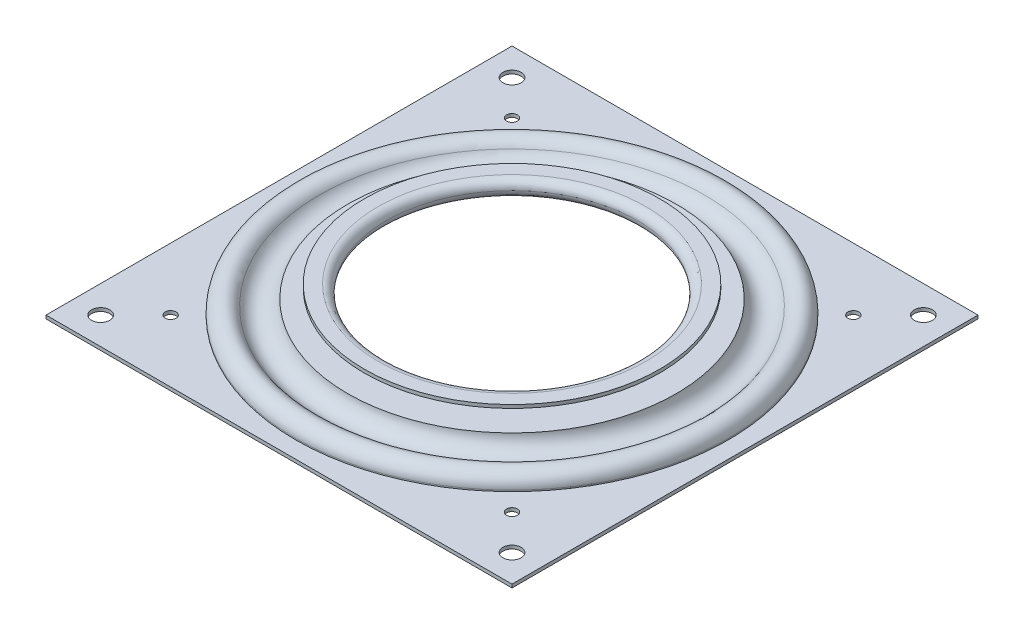
ISO-10303-21;
HEADER;
FILE_DESCRIPTION(('STEP AP214'),'2;1');
FILE_NAME('part.step','',(''),(''),'','','');
FILE_SCHEMA(('AUTOMOTIVE_DESIGN { 1 0 10303 214 1 1 1 1 }'));
ENDSEC;
DATA;
#1=APPLICATION_CONTEXT('core data for automotive mechanical design processes');
#2=APPLICATION_PROTOCOL_DEFINITION('international standard','automotive_design',2000,#1);
#3=PRODUCT_CONTEXT('',#1,'mechanical');
#4=PRODUCT('Part','Part','',(#3));
#5=PRODUCT_RELATED_PRODUCT_CATEGORY('part','',(#4));
#6=PRODUCT_DEFINITION_FORMATION('','',#4);
#7=PRODUCT_DEFINITION_CONTEXT('part definition',#1,'design');
#8=PRODUCT_DEFINITION('design','',#6,#7);
#9=PRODUCT_DEFINITION_SHAPE('','',#8);
#10=(LENGTH_UNIT() NAMED_UNIT(*) SI_UNIT(.MILLI.,.METRE.));
#11=(NAMED_UNIT(*) PLANE_ANGLE_UNIT() SI_UNIT($,.RADIAN.));
#12=(NAMED_UNIT(*) SI_UNIT($,.STERADIAN.) SOLID_ANGLE_UNIT());
#13=UNCERTAINTY_MEASURE_WITH_UNIT(LENGTH_MEASURE(1.E-05),#10,'distance_accuracy_value','');
#14=(GEOMETRIC_REPRESENTATION_CONTEXT(3) GLOBAL_UNCERTAINTY_ASSIGNED_CONTEXT((#13)) GLOBAL_UNIT_ASSIGNED_CONTEXT((#10,
#11,#12)) REPRESENTATION_CONTEXT('',''));
#15=CARTESIAN_POINT('',(0.,0.,0.));
#16=DIRECTION('',(0.,0.,1.));
#17=DIRECTION('',(1.,0.,0.));
#18=AXIS2_PLACEMENT_3D('',#15,#16,#17);
#19=CARTESIAN_POINT('',(0.,0.,0.));
#20=DIRECTION('',(0.,1.,0.));
#21=DIRECTION('',(0.,0.,1.));
#22=AXIS2_PLACEMENT_3D('',#19,#20,#21);
#23=TOROIDAL_SURFACE('',#22,29.21,1.778);
#24=CARTESIAN_POINT('',(0.,-1.778,0.));
#25=DIRECTION('',(0.,1.,0.));
#26=DIRECTION('',(0.,0.,1.));
#27=AXIS2_PLACEMENT_3D('',#24,#25,#26);
#28=CIRCLE('',#27,29.21);
#29=CARTESIAN_POINT('',(0.,-1.778,29.21));
#30=VERTEX_POINT('',#29);
#31=EDGE_CURVE('E116',#30,#30,#28,.T.);
#32=ORIENTED_EDGE('',*,*,#31,.F.);
#33=EDGE_LOOP('',(#32));
#34=FACE_BOUND('',#33,.T.);
#35=CARTESIAN_POINT('',(0.,0.,0.));
#36=DIRECTION('',(0.,1.,0.));
#37=DIRECTION('',(0.,0.,1.));
#38=AXIS2_PLACEMENT_3D('',#35,#36,#37);
#39=CIRCLE('',#38,27.432);
#40=CARTESIAN_POINT('',(0.,0.,27.432));
#41=VERTEX_POINT('',#40);
#42=EDGE_CURVE('E11',#41,#41,#39,.T.);
#43=ORIENTED_EDGE('',*,*,#42,.T.);
#44=EDGE_LOOP('',(#43));
#45=FACE_BOUND('',#44,.T.);
#46=ADVANCED_FACE('F34',(#34,#45),#23,.T.);
#47=CARTESIAN_POINT('',(46.4272908614699,-4.826,0.));
#48=DIRECTION('',(0.,1.,0.));
#49=DIRECTION('',(0.,0.,1.));
#50=AXIS2_PLACEMENT_3D('',#47,#48,#49);
#51=PLANE('',#50);
#52=CARTESIAN_POINT('',(37.211,-4.826,37.211));
#53=DIRECTION('',(0.,1.,0.));
#54=DIRECTION('',(0.,0.,1.));
#55=AXIS2_PLACEMENT_3D('',#52,#53,#54);
#56=CIRCLE('',#55,1.19062499999999);
#57=CARTESIAN_POINT('',(37.211,-4.826,38.401625));
#58=VERTEX_POINT('',#57);
#59=EDGE_CURVE('E423',#58,#58,#56,.T.);
#60=ORIENTED_EDGE('',*,*,#59,.T.);
#61=EDGE_LOOP('',(#60));
#62=FACE_BOUND('',#61,.T.);
#63=CARTESIAN_POINT('',(-37.211,-4.826,37.211));
#64=DIRECTION('',(0.,1.,0.));
#65=DIRECTION('',(0.,0.,1.));
#66=AXIS2_PLACEMENT_3D('',#63,#64,#65);
#67=CIRCLE('',#66,1.19062499999999);
#68=CARTESIAN_POINT('',(-37.211,-4.826,38.401625));
#69=VERTEX_POINT('',#68);
#70=EDGE_CURVE('E427',#69,#69,#67,.T.);
#71=ORIENTED_EDGE('',*,*,#70,.T.);
#72=EDGE_LOOP('',(#71));
#73=FACE_BOUND('',#72,.T.);
#74=CARTESIAN_POINT('',(-37.211,-4.826,-37.211));
#75=DIRECTION('',(0.,1.,0.));
#76=DIRECTION('',(0.,0.,1.));
#77=AXIS2_PLACEMENT_3D('',#74,#75,#76);
#78=CIRCLE('',#77,1.19062499999999);
#79=CARTESIAN_POINT('',(-37.211,-4.826,-36.020375));
#80=VERTEX_POINT('',#79);
#81=EDGE_CURVE('E436',#80,#80,#78,.T.);
#82=ORIENTED_EDGE('',*,*,#81,.T.);
#83=EDGE_LOOP('',(#82));
#84=FACE_BOUND('',#83,.T.);
#85=CARTESIAN_POINT('',(37.211,-4.826,-37.211));
#86=DIRECTION('',(0.,1.,0.));
#87=DIRECTION('',(0.,0.,1.));
#88=AXIS2_PLACEMENT_3D('',#85,#86,#87);
#89=CIRCLE('',#88,1.19062499999999);
#90=CARTESIAN_POINT('',(37.211,-4.826,-36.020375));
#91=VERTEX_POINT('',#90);
#92=EDGE_CURVE('E442',#91,#91,#89,.T.);
#93=ORIENTED_EDGE('',*,*,#92,.T.);
#94=EDGE_LOOP('',(#93));
#95=FACE_BOUND('',#94,.T.);
#96=CARTESIAN_POINT('',(44.8437,-4.826,-44.8437));
#97=DIRECTION('',(0.,1.,0.));
#98=DIRECTION('',(0.,0.,1.));
#99=AXIS2_PLACEMENT_3D('',#96,#97,#98);
#100=CIRCLE('',#99,1.984375);
#101=CARTESIAN_POINT('',(44.8437,-4.826,-42.859325));
#102=VERTEX_POINT('',#101);
#103=EDGE_CURVE('E448',#102,#102,#100,.T.);
#104=ORIENTED_EDGE('',*,*,#103,.T.);
#105=EDGE_LOOP('',(#104));
#106=FACE_BOUND('',#105,.T.);
#107=CARTESIAN_POINT('',(44.8437,-4.826,44.8437));
#108=DIRECTION('',(0.,1.,0.));
#109=DIRECTION('',(0.,0.,1.));
#110=AXIS2_PLACEMENT_3D('',#107,#108,#109);
#111=CIRCLE('',#110,1.984375);
#112=CARTESIAN_POINT('',(44.8437,-4.826,46.828075));
#113=VERTEX_POINT('',#112);
#114=EDGE_CURVE('E454',#113,#113,#111,.T.);
#115=ORIENTED_EDGE('',*,*,#114,.T.);
#116=EDGE_LOOP('',(#115));
#117=FACE_BOUND('',#116,.T.);
#118=CARTESIAN_POINT('',(-44.8437,-4.826,-44.8437));
#119=DIRECTION('',(0.,1.,0.));
#120=DIRECTION('',(0.,0.,1.));
#121=AXIS2_PLACEMENT_3D('',#118,#119,#120);
#122=CIRCLE('',#121,1.984375);
#123=CARTESIAN_POINT('',(-44.8437,-4.826,-42.859325));
#124=VERTEX_POINT('',#123);
#125=EDGE_CURVE('E460',#124,#124,#122,.T.);
#126=ORIENTED_EDGE('',*,*,#125,.T.);
#127=EDGE_LOOP('',(#126));
#128=FACE_BOUND('',#127,.T.);
#129=CARTESIAN_POINT('',(-44.8437,-4.826,44.8437));
#130=DIRECTION('',(0.,1.,0.));
#131=DIRECTION('',(0.,0.,1.));
#132=AXIS2_PLACEMENT_3D('',#129,#130,#131);
#133=CIRCLE('',#132,1.984375);
#134=CARTESIAN_POINT('',(-44.8437,-4.826,46.828075));
#135=VERTEX_POINT('',#134);
#136=EDGE_CURVE('E81',#135,#135,#133,.T.);
#137=ORIENTED_EDGE('',*,*,#136,.T.);
#138=EDGE_LOOP('',(#137));
#139=FACE_BOUND('',#138,.T.);
#140=DIRECTION('',(1.,0.,0.));
#141=VECTOR('',#140,1.);
#142=CARTESIAN_POINT('',(50.8,-4.826,-50.8));
#143=LINE('',#142,#141);
#144=CARTESIAN_POINT('',(-50.8,-4.826,-50.8));
#145=VERTEX_POINT('',#144);
#146=CARTESIAN_POINT('',(50.8,-4.826,-50.8));
#147=VERTEX_POINT('',#146);
#148=EDGE_CURVE('E94',#145,#147,#143,.T.);
#149=ORIENTED_EDGE('',*,*,#148,.T.);
#150=DIRECTION('',(0.,0.,1.));
#151=VECTOR('',#150,1.);
#152=CARTESIAN_POINT('',(50.8,-4.826,50.8));
#153=LINE('',#152,#151);
#154=CARTESIAN_POINT('',(50.8,-4.826,50.8));
#155=VERTEX_POINT('',#154);
#156=EDGE_CURVE('E472',#147,#155,#153,.T.);
#157=ORIENTED_EDGE('',*,*,#156,.T.);
#158=DIRECTION('',(-1.,0.,0.));
#159=VECTOR('',#158,1.);
#160=CARTESIAN_POINT('',(50.8,-4.826,50.8));
#161=LINE('',#160,#159);
#162=CARTESIAN_POINT('',(-50.8,-4.826,50.8));
#163=VERTEX_POINT('',#162);
#164=EDGE_CURVE('E469',#155,#163,#161,.T.);
#165=ORIENTED_EDGE('',*,*,#164,.T.);
#166=DIRECTION('',(0.,0.,-1.));
#167=VECTOR('',#166,1.);
#168=CARTESIAN_POINT('',(-50.8,-4.826,50.8));
#169=LINE('',#168,#167);
#170=EDGE_CURVE('E107',#163,#145,#169,.T.);
#171=ORIENTED_EDGE('',*,*,#170,.T.);
#172=EDGE_LOOP('',(#149,#157,#165,#171));
#173=FACE_BOUND('',#172,.T.);
#174=CARTESIAN_POINT('',(0.,-4.826,0.));
#175=DIRECTION('',(0.,1.,0.));
#176=DIRECTION('',(0.,0.,1.));
#177=AXIS2_PLACEMENT_3D('',#174,#175,#176);
#178=CIRCLE('',#177,46.4272908614699);
#179=CARTESIAN_POINT('',(0.,-4.826,46.4272908614699));
#180=VERTEX_POINT('',#179);
#181=EDGE_CURVE('E103',#180,#180,#178,.T.);
#182=ORIENTED_EDGE('',*,*,#181,.T.);
#183=EDGE_LOOP('',(#182));
#184=FACE_BOUND('',#183,.T.);
#185=ADVANCED_FACE('F36',(#62,#73,#84,#95,#106,#117,#128,#139,#173,#184),#51,.F.);
#186=CARTESIAN_POINT('',(46.4272908614699,-4.0894,0.));
#187=DIRECTION('',(0.,1.,0.));
#188=DIRECTION('',(0.,0.,1.));
#189=AXIS2_PLACEMENT_3D('',#186,#187,#188);
#190=PLANE('',#189);
#191=CARTESIAN_POINT('',(37.211,-4.08939999999999,37.211));
#192=DIRECTION('',(0.,1.,0.));
#193=DIRECTION('',(0.,0.,1.));
#194=AXIS2_PLACEMENT_3D('',#191,#192,#193);
#195=CIRCLE('',#194,1.19062499999999);
#196=CARTESIAN_POINT('',(37.211,-4.08939999999999,38.401625));
#197=VERTEX_POINT('',#196);
#198=EDGE_CURVE('E420',#197,#197,#195,.T.);
#199=ORIENTED_EDGE('',*,*,#198,.F.);
#200=EDGE_LOOP('',(#199));
#201=FACE_BOUND('',#200,.T.);
#202=CARTESIAN_POINT('',(-37.211,-4.08939999999999,37.211));
#203=DIRECTION('',(0.,1.,0.));
#204=DIRECTION('',(0.,0.,1.));
#205=AXIS2_PLACEMENT_3D('',#202,#203,#204);
#206=CIRCLE('',#205,1.19062499999999);
#207=CARTESIAN_POINT('',(-37.211,-4.08939999999999,38.401625));
#208=VERTEX_POINT('',#207);
#209=EDGE_CURVE('E424',#208,#208,#206,.T.);
#210=ORIENTED_EDGE('',*,*,#209,.F.);
#211=EDGE_LOOP('',(#210));
#212=FACE_BOUND('',#211,.T.);
#213=CARTESIAN_POINT('',(-37.211,-4.08939999999999,-37.211));
#214=DIRECTION('',(0.,1.,0.));
#215=DIRECTION('',(0.,0.,1.));
#216=AXIS2_PLACEMENT_3D('',#213,#214,#215);
#217=CIRCLE('',#216,1.19062499999999);
#218=CARTESIAN_POINT('',(-37.211,-4.08939999999999,-36.020375));
#219=VERTEX_POINT('',#218);
#220=EDGE_CURVE('E433',#219,#219,#217,.T.);
#221=ORIENTED_EDGE('',*,*,#220,.F.);
#222=EDGE_LOOP('',(#221));
#223=FACE_BOUND('',#222,.T.);
#224=CARTESIAN_POINT('',(37.211,-4.08939999999999,-37.211));
#225=DIRECTION('',(0.,1.,0.));
#226=DIRECTION('',(0.,0.,1.));
#227=AXIS2_PLACEMENT_3D('',#224,#225,#226);
#228=CIRCLE('',#227,1.19062499999999);
#229=CARTESIAN_POINT('',(37.211,-4.08939999999999,-36.020375));
#230=VERTEX_POINT('',#229);
#231=EDGE_CURVE('E439',#230,#230,#228,.T.);
#232=ORIENTED_EDGE('',*,*,#231,.F.);
#233=EDGE_LOOP('',(#232));
#234=FACE_BOUND('',#233,.T.);
#235=CARTESIAN_POINT('',(44.8437,-4.08939999999999,-44.8437));
#236=DIRECTION('',(0.,1.,0.));
#237=DIRECTION('',(0.,0.,1.));
#238=AXIS2_PLACEMENT_3D('',#235,#236,#237);
#239=CIRCLE('',#238,1.98437499999999);
#240=CARTESIAN_POINT('',(44.8437,-4.08939999999999,-42.859325));
#241=VERTEX_POINT('',#240);
#242=EDGE_CURVE('E445',#241,#241,#239,.T.);
#243=ORIENTED_EDGE('',*,*,#242,.F.);
#244=EDGE_LOOP('',(#243));
#245=FACE_BOUND('',#244,.T.);
#246=CARTESIAN_POINT('',(44.8437,-4.08939999999999,44.8437));
#247=DIRECTION('',(0.,1.,0.));
#248=DIRECTION('',(0.,0.,1.));
#249=AXIS2_PLACEMENT_3D('',#246,#247,#248);
#250=CIRCLE('',#249,1.98437499999999);
#251=CARTESIAN_POINT('',(44.8437,-4.08939999999999,46.828075));
#252=VERTEX_POINT('',#251);
#253=EDGE_CURVE('E451',#252,#252,#250,.T.);
#254=ORIENTED_EDGE('',*,*,#253,.F.);
#255=EDGE_LOOP('',(#254));
#256=FACE_BOUND('',#255,.T.);
#257=CARTESIAN_POINT('',(-44.8437,-4.08939999999999,-44.8437));
#258=DIRECTION('',(0.,1.,0.));
#259=DIRECTION('',(0.,0.,1.));
#260=AXIS2_PLACEMENT_3D('',#257,#258,#259);
#261=CIRCLE('',#260,1.98437499999999);
#262=CARTESIAN_POINT('',(-44.8437,-4.08939999999999,-42.859325));
#263=VERTEX_POINT('',#262);
#264=EDGE_CURVE('E457',#263,#263,#261,.T.);
#265=ORIENTED_EDGE('',*,*,#264,.F.);
#266=EDGE_LOOP('',(#265));
#267=FACE_BOUND('',#266,.T.);
#268=CARTESIAN_POINT('',(-44.8437,-4.08939999999999,44.8437));
#269=DIRECTION('',(0.,1.,0.));
#270=DIRECTION('',(0.,0.,1.));
#271=AXIS2_PLACEMENT_3D('',#268,#269,#270);
#272=CIRCLE('',#271,1.98437499999999);
#273=CARTESIAN_POINT('',(-44.8437,-4.08939999999999,46.828075));
#274=VERTEX_POINT('',#273);
#275=EDGE_CURVE('E463',#274,#274,#272,.T.);
#276=ORIENTED_EDGE('',*,*,#275,.F.);
#277=EDGE_LOOP('',(#276));
#278=FACE_BOUND('',#277,.T.);
#279=DIRECTION('',(0.,0.,-1.));
#280=VECTOR('',#279,1.);
#281=CARTESIAN_POINT('',(-50.8,-4.0894,50.8));
#282=LINE('',#281,#280);
#283=CARTESIAN_POINT('',(-50.8,-4.0894,50.8));
#284=VERTEX_POINT('',#283);
#285=CARTESIAN_POINT('',(-50.8,-4.0894,-50.8));
#286=VERTEX_POINT('',#285);
#287=EDGE_CURVE('E75',#284,#286,#282,.T.);
#288=ORIENTED_EDGE('',*,*,#287,.F.);
#289=DIRECTION('',(-1.,0.,0.));
#290=VECTOR('',#289,1.);
#291=CARTESIAN_POINT('',(50.8,-4.0894,50.8));
#292=LINE('',#291,#290);
#293=CARTESIAN_POINT('',(50.8,-4.0894,50.8));
#294=VERTEX_POINT('',#293);
#295=EDGE_CURVE('E56',#294,#284,#292,.T.);
#296=ORIENTED_EDGE('',*,*,#295,.F.);
#297=DIRECTION('',(0.,0.,1.));
#298=VECTOR('',#297,1.);
#299=CARTESIAN_POINT('',(50.8,-4.0894,50.8));
#300=LINE('',#299,#298);
#301=CARTESIAN_POINT('',(50.8,-4.0894,-50.8));
#302=VERTEX_POINT('',#301);
#303=EDGE_CURVE('E50',#302,#294,#300,.T.);
#304=ORIENTED_EDGE('',*,*,#303,.F.);
#305=DIRECTION('',(1.,0.,0.));
#306=VECTOR('',#305,1.);
#307=CARTESIAN_POINT('',(50.8,-4.0894,-50.8));
#308=LINE('',#307,#306);
#309=EDGE_CURVE('E71',#286,#302,#308,.T.);
#310=ORIENTED_EDGE('',*,*,#309,.F.);
#311=EDGE_LOOP('',(#288,#296,#304,#310));
#312=FACE_BOUND('',#311,.T.);
#313=CARTESIAN_POINT('',(0.,-4.08939999999999,0.));
#314=DIRECTION('',(0.,1.,0.));
#315=DIRECTION('',(0.,0.,1.));
#316=AXIS2_PLACEMENT_3D('',#313,#314,#315);
#317=CIRCLE('',#316,47.1638908614699);
#318=CARTESIAN_POINT('',(0.,-4.08939999999999,47.1638908614699));
#319=VERTEX_POINT('',#318);
#320=EDGE_CURVE('E43',#319,#319,#317,.T.);
#321=ORIENTED_EDGE('',*,*,#320,.F.);
#322=EDGE_LOOP('',(#321));
#323=FACE_BOUND('',#322,.T.);
#324=ADVANCED_FACE('F73',(#201,#212,#223,#234,#245,#256,#267,#278,#312,#323),#190,.T.);
#325=CARTESIAN_POINT('',(0.,21.7127262600922,0.));
#326=DIRECTION('',(0.,1.,0.));
#327=DIRECTION('',(0.,0.,1.));
#328=AXIS2_PLACEMENT_3D('',#325,#326,#327);
#329=CYLINDRICAL_SURFACE('',#328,47.1638908614699);
#330=ORIENTED_EDGE('',*,*,#320,.T.);
#331=EDGE_LOOP('',(#330));
#332=FACE_BOUND('',#331,.T.);
#333=CARTESIAN_POINT('',(0.,-3.81,0.));
#334=DIRECTION('',(0.,1.,0.));
#335=DIRECTION('',(0.,0.,1.));
#336=AXIS2_PLACEMENT_3D('',#333,#334,#335);
#337=CIRCLE('',#336,47.1638908614699);
#338=CARTESIAN_POINT('',(0.,-3.81,47.1638908614699));
#339=VERTEX_POINT('',#338);
#340=EDGE_CURVE('E140',#339,#339,#337,.T.);
#341=ORIENTED_EDGE('',*,*,#340,.F.);
#342=EDGE_LOOP('',(#341));
#343=FACE_BOUND('',#342,.T.);
#344=ADVANCED_FACE('F145',(#332,#343),#329,.T.);
#345=CARTESIAN_POINT('',(0.,-3.81,0.));
#346=DIRECTION('',(0.,1.,0.));
#347=DIRECTION('',(0.,0.,1.));
#348=AXIS2_PLACEMENT_3D('',#345,#346,#347);
#349=TOROIDAL_SURFACE('',#348,44.3952908614699,2.7686);
#350=ORIENTED_EDGE('',*,*,#340,.T.);
#351=EDGE_LOOP('',(#350));
#352=FACE_BOUND('',#351,.T.);
#353=CARTESIAN_POINT('',(0.,-2.4257,0.));
#354=DIRECTION('',(0.,1.,0.));
#355=DIRECTION('',(0.,0.,1.));
#356=AXIS2_PLACEMENT_3D('',#353,#354,#355);
#357=CIRCLE('',#356,41.9976129285523);
#358=CARTESIAN_POINT('',(0.,-2.4257,41.9976129285523));
#359=VERTEX_POINT('',#358);
#360=EDGE_CURVE('E137',#359,#359,#357,.T.);
#361=ORIENTED_EDGE('',*,*,#360,.F.);
#362=EDGE_LOOP('',(#361));
#363=FACE_BOUND('',#362,.T.);
#364=ADVANCED_FACE('F153',(#352,#363),#349,.T.);
#365=CARTESIAN_POINT('',(0.,-0.761999999999995,0.));
#366=DIRECTION('',(0.,1.,0.));
#367=DIRECTION('',(0.,0.,1.));
#368=AXIS2_PLACEMENT_3D('',#365,#366,#367);
#369=TOROIDAL_SURFACE('',#368,39.116,3.3274);
#370=ORIENTED_EDGE('',*,*,#360,.T.);
#371=EDGE_LOOP('',(#370));
#372=FACE_BOUND('',#371,.T.);
#373=CARTESIAN_POINT('',(0.,-1.0414,0.));
#374=DIRECTION('',(0.,1.,0.));
#375=DIRECTION('',(0.,0.,1.));
#376=AXIS2_PLACEMENT_3D('',#373,#374,#375);
#377=CIRCLE('',#376,35.8003512851932);
#378=CARTESIAN_POINT('',(0.,-1.0414,35.8003512851932));
#379=VERTEX_POINT('',#378);
#380=EDGE_CURVE('E134',#379,#379,#377,.T.);
#381=ORIENTED_EDGE('',*,*,#380,.F.);
#382=EDGE_LOOP('',(#381));
#383=FACE_BOUND('',#382,.T.);
#384=ADVANCED_FACE('F203',(#372,#383),#369,.F.);
#385=CARTESIAN_POINT('',(29.21,-1.0414,0.));
#386=DIRECTION('',(0.,1.,0.));
#387=DIRECTION('',(0.,0.,1.));
#388=AXIS2_PLACEMENT_3D('',#385,#386,#387);
#389=PLANE('',#388);
#390=ORIENTED_EDGE('',*,*,#380,.T.);
#391=EDGE_LOOP('',(#390));
#392=FACE_BOUND('',#391,.T.);
#393=CARTESIAN_POINT('',(0.,-1.0414,0.));
#394=DIRECTION('',(0.,1.,0.));
#395=DIRECTION('',(0.,0.,1.));
#396=AXIS2_PLACEMENT_3D('',#393,#394,#395);
#397=CIRCLE('',#396,29.21);
#398=CARTESIAN_POINT('',(0.,-1.0414,29.21));
#399=VERTEX_POINT('',#398);
#400=EDGE_CURVE('E131',#399,#399,#397,.T.);
#401=ORIENTED_EDGE('',*,*,#400,.F.);
#402=EDGE_LOOP('',(#401));
#403=FACE_BOUND('',#402,.T.);
#404=ADVANCED_FACE('F199',(#392,#403),#389,.T.);
#405=CARTESIAN_POINT('',(0.,0.,0.));
#406=DIRECTION('',(0.,1.,0.));
#407=DIRECTION('',(0.,0.,1.));
#408=AXIS2_PLACEMENT_3D('',#405,#406,#407);
#409=TOROIDAL_SURFACE('',#408,29.21,1.0414);
#410=ORIENTED_EDGE('',*,*,#400,.T.);
#411=EDGE_LOOP('',(#410));
#412=FACE_BOUND('',#411,.T.);
#413=CARTESIAN_POINT('',(0.,1.0414,0.));
#414=DIRECTION('',(0.,1.,0.));
#415=DIRECTION('',(0.,0.,1.));
#416=AXIS2_PLACEMENT_3D('',#413,#414,#415);
#417=CIRCLE('',#416,29.21);
#418=CARTESIAN_POINT('',(0.,1.0414,29.21));
#419=VERTEX_POINT('',#418);
#420=EDGE_CURVE('E128',#419,#419,#417,.T.);
#421=ORIENTED_EDGE('',*,*,#420,.F.);
#422=EDGE_LOOP('',(#421));
#423=FACE_BOUND('',#422,.T.);
#424=ADVANCED_FACE('F193',(#412,#423),#409,.F.);
#425=CARTESIAN_POINT('',(32.1955244601266,1.0414,0.));
#426=DIRECTION('',(0.,-1.,0.));
#427=DIRECTION('',(0.,0.,-1.));
#428=AXIS2_PLACEMENT_3D('',#425,#426,#427);
#429=PLANE('',#428);
#430=ORIENTED_EDGE('',*,*,#420,.T.);
#431=EDGE_LOOP('',(#430));
#432=FACE_BOUND('',#431,.T.);
#433=CARTESIAN_POINT('',(0.,1.0414,0.));
#434=DIRECTION('',(0.,1.,0.));
#435=DIRECTION('',(0.,0.,1.));
#436=AXIS2_PLACEMENT_3D('',#433,#434,#435);
#437=CIRCLE('',#436,32.1955244601266);
#438=CARTESIAN_POINT('',(0.,1.0414,32.1955244601266));
#439=VERTEX_POINT('',#438);
#440=EDGE_CURVE('E125',#439,#439,#437,.T.);
#441=ORIENTED_EDGE('',*,*,#440,.F.);
#442=EDGE_LOOP('',(#441));
#443=FACE_BOUND('',#442,.T.);
#444=ADVANCED_FACE('F187',(#432,#443),#429,.T.);
#445=CARTESIAN_POINT('',(0.,21.7127262600922,0.));
#446=DIRECTION('',(0.,1.,0.));
#447=DIRECTION('',(0.,0.,1.));
#448=AXIS2_PLACEMENT_3D('',#445,#446,#447);
#449=CYLINDRICAL_SURFACE('',#448,32.1955244601266);
#450=ORIENTED_EDGE('',*,*,#440,.T.);
#451=EDGE_LOOP('',(#450));
#452=FACE_BOUND('',#451,.T.);
#453=CARTESIAN_POINT('',(0.,1.778,0.));
#454=DIRECTION('',(0.,1.,0.));
#455=DIRECTION('',(0.,0.,1.));
#456=AXIS2_PLACEMENT_3D('',#453,#454,#455);
#457=CIRCLE('',#456,32.1955244601266);
#458=CARTESIAN_POINT('',(0.,1.778,32.1955244601266));
#459=VERTEX_POINT('',#458);
#460=EDGE_CURVE('E122',#459,#459,#457,.T.);
#461=ORIENTED_EDGE('',*,*,#460,.F.);
#462=EDGE_LOOP('',(#461));
#463=FACE_BOUND('',#462,.T.);
#464=ADVANCED_FACE('F178',(#452,#463),#449,.T.);
#465=CARTESIAN_POINT('',(32.1955244601266,1.778,0.));
#466=DIRECTION('',(0.,-1.,0.));
#467=DIRECTION('',(0.,0.,-1.));
#468=AXIS2_PLACEMENT_3D('',#465,#466,#467);
#469=PLANE('',#468);
#470=CARTESIAN_POINT('',(0.,1.778,0.));
#471=DIRECTION('',(0.,1.,0.));
#472=DIRECTION('',(0.,0.,1.));
#473=AXIS2_PLACEMENT_3D('',#470,#471,#472);
#474=CIRCLE('',#473,29.21);
#475=CARTESIAN_POINT('',(0.,1.778,29.21));
#476=VERTEX_POINT('',#475);
#477=EDGE_CURVE('E119',#476,#476,#474,.T.);
#478=ORIENTED_EDGE('',*,*,#477,.F.);
#479=EDGE_LOOP('',(#478));
#480=FACE_BOUND('',#479,.T.);
#481=ORIENTED_EDGE('',*,*,#460,.T.);
#482=EDGE_LOOP('',(#481));
#483=FACE_BOUND('',#482,.T.);
#484=ADVANCED_FACE('F170',(#480,#483),#469,.F.);
#485=ORIENTED_EDGE('',*,*,#42,.F.);
#486=EDGE_LOOP('',(#485));
#487=FACE_BOUND('',#486,.T.);
#488=ORIENTED_EDGE('',*,*,#477,.T.);
#489=EDGE_LOOP('',(#488));
#490=FACE_BOUND('',#489,.T.);
#491=ADVANCED_FACE('F161',(#487,#490),#23,.T.);
#492=CARTESIAN_POINT('',(29.21,-1.778,0.));
#493=DIRECTION('',(0.,1.,0.));
#494=DIRECTION('',(0.,0.,1.));
#495=AXIS2_PLACEMENT_3D('',#492,#493,#494);
#496=PLANE('',#495);
#497=CARTESIAN_POINT('',(0.,-1.778,0.));
#498=DIRECTION('',(0.,1.,0.));
#499=DIRECTION('',(0.,0.,1.));
#500=AXIS2_PLACEMENT_3D('',#497,#498,#499);
#501=CIRCLE('',#500,35.1810489202533);
#502=CARTESIAN_POINT('',(0.,-1.778,35.1810489202533));
#503=VERTEX_POINT('',#502);
#504=EDGE_CURVE('E113',#503,#503,#501,.T.);
#505=ORIENTED_EDGE('',*,*,#504,.F.);
#506=EDGE_LOOP('',(#505));
#507=FACE_BOUND('',#506,.T.);
#508=ORIENTED_EDGE('',*,*,#31,.T.);
#509=EDGE_LOOP('',(#508));
#510=FACE_BOUND('',#509,.T.);
#511=ADVANCED_FACE('F169',(#507,#510),#496,.F.);
#512=CARTESIAN_POINT('',(0.,-0.761999999999995,0.));
#513=DIRECTION('',(0.,1.,0.));
#514=DIRECTION('',(0.,0.,1.));
#515=AXIS2_PLACEMENT_3D('',#512,#513,#514);
#516=TOROIDAL_SURFACE('',#515,39.116,4.064);
#517=CARTESIAN_POINT('',(0.,-2.794,0.));
#518=DIRECTION('',(0.,1.,0.));
#519=DIRECTION('',(0.,0.,1.));
#520=AXIS2_PLACEMENT_3D('',#517,#518,#519);
#521=CIRCLE('',#520,42.63552724098);
#522=CARTESIAN_POINT('',(0.,-2.794,42.63552724098));
#523=VERTEX_POINT('',#522);
#524=EDGE_CURVE('E110',#523,#523,#521,.T.);
#525=ORIENTED_EDGE('',*,*,#524,.F.);
#526=EDGE_LOOP('',(#525));
#527=FACE_BOUND('',#526,.T.);
#528=ORIENTED_EDGE('',*,*,#504,.T.);
#529=EDGE_LOOP('',(#528));
#530=FACE_BOUND('',#529,.T.);
#531=ADVANCED_FACE('F176',(#527,#530),#516,.T.);
#532=CARTESIAN_POINT('',(0.,-3.81,0.));
#533=DIRECTION('',(0.,1.,0.));
#534=DIRECTION('',(0.,0.,1.));
#535=AXIS2_PLACEMENT_3D('',#532,#533,#534);
#536=TOROIDAL_SURFACE('',#535,44.3952908614699,2.032);
#537=CARTESIAN_POINT('',(0.,-3.81,0.));
#538=DIRECTION('',(0.,1.,0.));
#539=DIRECTION('',(0.,0.,1.));
#540=AXIS2_PLACEMENT_3D('',#537,#538,#539);
#541=CIRCLE('',#540,46.4272908614699);
#542=CARTESIAN_POINT('',(0.,-3.81,46.4272908614699));
#543=VERTEX_POINT('',#542);
#544=EDGE_CURVE('E106',#543,#543,#541,.T.);
#545=ORIENTED_EDGE('',*,*,#544,.F.);
#546=EDGE_LOOP('',(#545));
#547=FACE_BOUND('',#546,.T.);
#548=ORIENTED_EDGE('',*,*,#524,.T.);
#549=EDGE_LOOP('',(#548));
#550=FACE_BOUND('',#549,.T.);
#551=ADVANCED_FACE('F279',(#547,#550),#536,.F.);
#552=CARTESIAN_POINT('',(0.,21.7127262600922,0.));
#553=DIRECTION('',(0.,1.,0.));
#554=DIRECTION('',(0.,0.,1.));
#555=AXIS2_PLACEMENT_3D('',#552,#553,#554);
#556=CYLINDRICAL_SURFACE('',#555,46.4272908614699);
#557=ORIENTED_EDGE('',*,*,#544,.T.);
#558=EDGE_LOOP('',(#557));
#559=FACE_BOUND('',#558,.T.);
#560=ORIENTED_EDGE('',*,*,#181,.F.);
#561=EDGE_LOOP('',(#560));
#562=FACE_BOUND('',#561,.T.);
#563=ADVANCED_FACE('F289',(#559,#562),#556,.F.);
#564=CARTESIAN_POINT('',(50.8,139.594697937107,-50.8));
#565=DIRECTION('',(0.,0.,-1.));
#566=DIRECTION('',(-1.,0.,0.));
#567=AXIS2_PLACEMENT_3D('',#564,#565,#566);
#568=PLANE('',#567);
#569=DIRECTION('',(0.,-1.,0.));
#570=VECTOR('',#569,1.);
#571=CARTESIAN_POINT('',(50.8,139.594697937107,-50.8));
#572=LINE('',#571,#570);
#573=EDGE_CURVE('E80',#302,#147,#572,.T.);
#574=ORIENTED_EDGE('',*,*,#573,.T.);
#575=ORIENTED_EDGE('',*,*,#148,.F.);
#576=DIRECTION('',(0.,-1.,0.));
#577=VECTOR('',#576,1.);
#578=CARTESIAN_POINT('',(-50.8,139.594697937107,-50.8));
#579=LINE('',#578,#577);
#580=EDGE_CURVE('E87',#286,#145,#579,.T.);
#581=ORIENTED_EDGE('',*,*,#580,.F.);
#582=ORIENTED_EDGE('',*,*,#309,.T.);
#583=EDGE_LOOP('',(#574,#575,#581,#582));
#584=FACE_BOUND('',#583,.T.);
#585=ADVANCED_FACE('F92',(#584),#568,.T.);
#586=CARTESIAN_POINT('',(-50.8,139.594697937107,50.8));
#587=DIRECTION('',(-1.,0.,0.));
#588=DIRECTION('',(0.,0.,1.));
#589=AXIS2_PLACEMENT_3D('',#586,#587,#588);
#590=PLANE('',#589);
#591=ORIENTED_EDGE('',*,*,#170,.F.);
#592=DIRECTION('',(0.,-1.,0.));
#593=VECTOR('',#592,1.);
#594=CARTESIAN_POINT('',(-50.8,139.594697937107,50.8));
#595=LINE('',#594,#593);
#596=EDGE_CURVE('E90',#284,#163,#595,.T.);
#597=ORIENTED_EDGE('',*,*,#596,.F.);
#598=ORIENTED_EDGE('',*,*,#287,.T.);
#599=ORIENTED_EDGE('',*,*,#580,.T.);
#600=EDGE_LOOP('',(#591,#597,#598,#599));
#601=FACE_BOUND('',#600,.T.);
#602=ADVANCED_FACE('F86',(#601),#590,.T.);
#603=CARTESIAN_POINT('',(50.8,139.594697937107,50.8));
#604=DIRECTION('',(0.,0.,1.));
#605=DIRECTION('',(1.,0.,0.));
#606=AXIS2_PLACEMENT_3D('',#603,#604,#605);
#607=PLANE('',#606);
#608=ORIENTED_EDGE('',*,*,#164,.F.);
#609=DIRECTION('',(0.,-1.,0.));
#610=VECTOR('',#609,1.);
#611=CARTESIAN_POINT('',(50.8,139.594697937107,50.8));
#612=LINE('',#611,#610);
#613=EDGE_CURVE('E99',#294,#155,#612,.T.);
#614=ORIENTED_EDGE('',*,*,#613,.F.);
#615=ORIENTED_EDGE('',*,*,#295,.T.);
#616=ORIENTED_EDGE('',*,*,#596,.T.);
#617=EDGE_LOOP('',(#608,#614,#615,#616));
#618=FACE_BOUND('',#617,.T.);
#619=ADVANCED_FACE('F316',(#618),#607,.T.);
#620=CARTESIAN_POINT('',(50.8,139.594697937107,50.8));
#621=DIRECTION('',(1.,0.,0.));
#622=DIRECTION('',(0.,0.,-1.));
#623=AXIS2_PLACEMENT_3D('',#620,#621,#622);
#624=PLANE('',#623);
#625=ORIENTED_EDGE('',*,*,#156,.F.);
#626=ORIENTED_EDGE('',*,*,#573,.F.);
#627=ORIENTED_EDGE('',*,*,#303,.T.);
#628=ORIENTED_EDGE('',*,*,#613,.T.);
#629=EDGE_LOOP('',(#625,#626,#627,#628));
#630=FACE_BOUND('',#629,.T.);
#631=ADVANCED_FACE('F325',(#630),#624,.T.);
#632=CARTESIAN_POINT('',(-44.8437,-4.0894,44.8437));
#633=DIRECTION('',(0.,1.,0.));
#634=DIRECTION('',(0.,0.,1.));
#635=AXIS2_PLACEMENT_3D('',#632,#633,#634);
#636=CYLINDRICAL_SURFACE('',#635,1.98437499999999);
#637=ORIENTED_EDGE('',*,*,#136,.F.);
#638=EDGE_LOOP('',(#637));
#639=FACE_BOUND('',#638,.T.);
#640=ORIENTED_EDGE('',*,*,#275,.T.);
#641=EDGE_LOOP('',(#640));
#642=FACE_BOUND('',#641,.T.);
#643=ADVANCED_FACE('F335',(#639,#642),#636,.F.);
#644=CARTESIAN_POINT('',(-44.8437,-4.0894,-44.8437));
#645=DIRECTION('',(0.,1.,0.));
#646=DIRECTION('',(0.,0.,1.));
#647=AXIS2_PLACEMENT_3D('',#644,#645,#646);
#648=CYLINDRICAL_SURFACE('',#647,1.98437499999999);
#649=ORIENTED_EDGE('',*,*,#125,.F.);
#650=EDGE_LOOP('',(#649));
#651=FACE_BOUND('',#650,.T.);
#652=ORIENTED_EDGE('',*,*,#264,.T.);
#653=EDGE_LOOP('',(#652));
#654=FACE_BOUND('',#653,.T.);
#655=ADVANCED_FACE('F345',(#651,#654),#648,.F.);
#656=CARTESIAN_POINT('',(44.8437,-4.0894,44.8437));
#657=DIRECTION('',(0.,1.,0.));
#658=DIRECTION('',(0.,0.,1.));
#659=AXIS2_PLACEMENT_3D('',#656,#657,#658);
#660=CYLINDRICAL_SURFACE('',#659,1.98437499999999);
#661=ORIENTED_EDGE('',*,*,#114,.F.);
#662=EDGE_LOOP('',(#661));
#663=FACE_BOUND('',#662,.T.);
#664=ORIENTED_EDGE('',*,*,#253,.T.);
#665=EDGE_LOOP('',(#664));
#666=FACE_BOUND('',#665,.T.);
#667=ADVANCED_FACE('F355',(#663,#666),#660,.F.);
#668=CARTESIAN_POINT('',(44.8437,-4.0894,-44.8437));
#669=DIRECTION('',(0.,1.,0.));
#670=DIRECTION('',(0.,0.,1.));
#671=AXIS2_PLACEMENT_3D('',#668,#669,#670);
#672=CYLINDRICAL_SURFACE('',#671,1.98437499999999);
#673=ORIENTED_EDGE('',*,*,#103,.F.);
#674=EDGE_LOOP('',(#673));
#675=FACE_BOUND('',#674,.T.);
#676=ORIENTED_EDGE('',*,*,#242,.T.);
#677=EDGE_LOOP('',(#676));
#678=FACE_BOUND('',#677,.T.);
#679=ADVANCED_FACE('F365',(#675,#678),#672,.F.);
#680=CARTESIAN_POINT('',(37.211,-4.0894,-37.211));
#681=DIRECTION('',(0.,1.,0.));
#682=DIRECTION('',(0.,0.,1.));
#683=AXIS2_PLACEMENT_3D('',#680,#681,#682);
#684=CYLINDRICAL_SURFACE('',#683,1.19062499999999);
#685=ORIENTED_EDGE('',*,*,#231,.T.);
#686=EDGE_LOOP('',(#685));
#687=FACE_BOUND('',#686,.T.);
#688=ORIENTED_EDGE('',*,*,#92,.F.);
#689=EDGE_LOOP('',(#688));
#690=FACE_BOUND('',#689,.T.);
#691=ADVANCED_FACE('F375',(#687,#690),#684,.F.);
#692=CARTESIAN_POINT('',(-37.211,-4.0894,-37.211));
#693=DIRECTION('',(0.,1.,0.));
#694=DIRECTION('',(0.,0.,1.));
#695=AXIS2_PLACEMENT_3D('',#692,#693,#694);
#696=CYLINDRICAL_SURFACE('',#695,1.19062499999999);
#697=ORIENTED_EDGE('',*,*,#220,.T.);
#698=EDGE_LOOP('',(#697));
#699=FACE_BOUND('',#698,.T.);
#700=ORIENTED_EDGE('',*,*,#81,.F.);
#701=EDGE_LOOP('',(#700));
#702=FACE_BOUND('',#701,.T.);
#703=ADVANCED_FACE('F385',(#699,#702),#696,.F.);
#704=CARTESIAN_POINT('',(-37.211,-4.0894,37.211));
#705=DIRECTION('',(0.,1.,0.));
#706=DIRECTION('',(0.,0.,1.));
#707=AXIS2_PLACEMENT_3D('',#704,#705,#706);
#708=CYLINDRICAL_SURFACE('',#707,1.19062499999999);
#709=ORIENTED_EDGE('',*,*,#209,.T.);
#710=EDGE_LOOP('',(#709));
#711=FACE_BOUND('',#710,.T.);
#712=ORIENTED_EDGE('',*,*,#70,.F.);
#713=EDGE_LOOP('',(#712));
#714=FACE_BOUND('',#713,.T.);
#715=ADVANCED_FACE('F395',(#711,#714),#708,.F.);
#716=CARTESIAN_POINT('',(37.211,-4.0894,37.211));
#717=DIRECTION('',(0.,1.,0.));
#718=DIRECTION('',(0.,0.,1.));
#719=AXIS2_PLACEMENT_3D('',#716,#717,#718);
#720=CYLINDRICAL_SURFACE('',#719,1.19062499999999);
#721=ORIENTED_EDGE('',*,*,#198,.T.);
#722=EDGE_LOOP('',(#721));
#723=FACE_BOUND('',#722,.T.);
#724=ORIENTED_EDGE('',*,*,#59,.F.);
#725=EDGE_LOOP('',(#724));
#726=FACE_BOUND('',#725,.T.);
#727=ADVANCED_FACE('F405',(#723,#726),#720,.F.);
#728=CLOSED_SHELL('',(#46,#185,#324,#344,#364,#384,#404,#424,#444,#464,#484,#491,#511,#531,#551,
#563,#585,#602,#619,#631,#643,#655,#667,#679,#691,#703,#715,#727));
#729=MANIFOLD_SOLID_BREP('B2',#728);
#730=ADVANCED_BREP_SHAPE_REPRESENTATION('',(#18,#729),#14);
#731=SHAPE_DEFINITION_REPRESENTATION(#9,#730);
ENDSEC;
END-ISO-10303-21;
